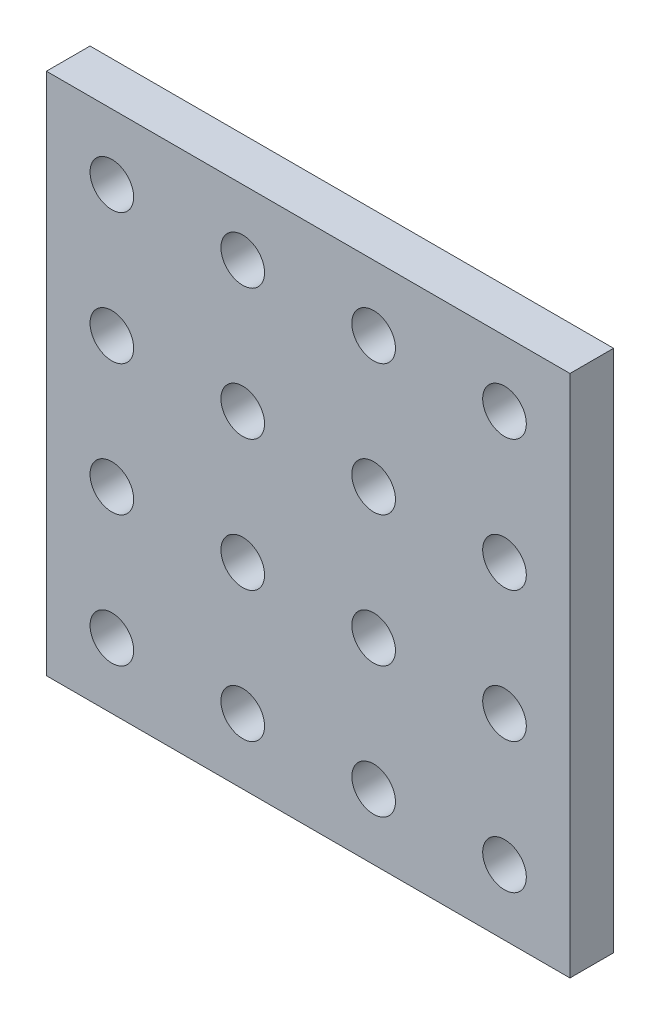
ISO-10303-21;
HEADER;
FILE_DESCRIPTION(('STEP AP214'),'2;1');
FILE_NAME('part.step','',(''),(''),'','','');
FILE_SCHEMA(('AUTOMOTIVE_DESIGN { 1 0 10303 214 1 1 1 1 }'));
ENDSEC;
DATA;
#1=APPLICATION_CONTEXT('core data for automotive mechanical design processes');
#2=APPLICATION_PROTOCOL_DEFINITION('international standard','automotive_design',2000,#1);
#3=PRODUCT_CONTEXT('',#1,'mechanical');
#4=PRODUCT('Part','Part','',(#3));
#5=PRODUCT_RELATED_PRODUCT_CATEGORY('part','',(#4));
#6=PRODUCT_DEFINITION_FORMATION('','',#4);
#7=PRODUCT_DEFINITION_CONTEXT('part definition',#1,'design');
#8=PRODUCT_DEFINITION('design','',#6,#7);
#9=PRODUCT_DEFINITION_SHAPE('','',#8);
#10=(LENGTH_UNIT() NAMED_UNIT(*) SI_UNIT(.MILLI.,.METRE.));
#11=(NAMED_UNIT(*) PLANE_ANGLE_UNIT() SI_UNIT($,.RADIAN.));
#12=(NAMED_UNIT(*) SI_UNIT($,.STERADIAN.) SOLID_ANGLE_UNIT());
#13=UNCERTAINTY_MEASURE_WITH_UNIT(LENGTH_MEASURE(1.E-05),#10,'distance_accuracy_value','');
#14=(GEOMETRIC_REPRESENTATION_CONTEXT(3) GLOBAL_UNCERTAINTY_ASSIGNED_CONTEXT((#13)) GLOBAL_UNIT_ASSIGNED_CONTEXT((#10,
#11,#12)) REPRESENTATION_CONTEXT('',''));
#15=CARTESIAN_POINT('',(0.,0.,0.));
#16=DIRECTION('',(0.,0.,1.));
#17=DIRECTION('',(1.,0.,0.));
#18=AXIS2_PLACEMENT_3D('',#15,#16,#17);
#19=CARTESIAN_POINT('',(0.,0.,10.));
#20=DIRECTION('',(0.,0.,1.));
#21=DIRECTION('',(1.,0.,0.));
#22=AXIS2_PLACEMENT_3D('',#19,#20,#21);
#23=PLANE('',#22);
#24=CARTESIAN_POINT('',(15.0000000000006,44.9999999999999,10.));
#25=DIRECTION('',(0.,0.,1.));
#26=DIRECTION('',(1.,0.,0.));
#27=AXIS2_PLACEMENT_3D('',#24,#25,#26);
#28=CIRCLE('',#27,5.);
#29=CARTESIAN_POINT('',(20.0000000000006,44.9999999999999,10.));
#30=VERTEX_POINT('',#29);
#31=EDGE_CURVE('E280',#30,#30,#28,.T.);
#32=ORIENTED_EDGE('',*,*,#31,.F.);
#33=EDGE_LOOP('',(#32));
#34=FACE_BOUND('',#33,.T.);
#35=CARTESIAN_POINT('',(105.000000000001,15.,10.));
#36=DIRECTION('',(0.,0.,1.));
#37=DIRECTION('',(1.,0.,0.));
#38=AXIS2_PLACEMENT_3D('',#35,#36,#37);
#39=CIRCLE('',#38,5.00000000000001);
#40=CARTESIAN_POINT('',(110.000000000001,14.9999999999999,10.));
#41=VERTEX_POINT('',#40);
#42=EDGE_CURVE('E292',#41,#41,#39,.T.);
#43=ORIENTED_EDGE('',*,*,#42,.F.);
#44=EDGE_LOOP('',(#43));
#45=FACE_BOUND('',#44,.T.);
#46=CARTESIAN_POINT('',(45.0000000000009,14.9999999999999,10.));
#47=DIRECTION('',(0.,0.,1.));
#48=DIRECTION('',(1.,0.,0.));
#49=AXIS2_PLACEMENT_3D('',#46,#47,#48);
#50=CIRCLE('',#49,5.);
#51=CARTESIAN_POINT('',(50.0000000000009,14.9999999999999,10.));
#52=VERTEX_POINT('',#51);
#53=EDGE_CURVE('E304',#52,#52,#50,.T.);
#54=ORIENTED_EDGE('',*,*,#53,.F.);
#55=EDGE_LOOP('',(#54));
#56=FACE_BOUND('',#55,.T.);
#57=CARTESIAN_POINT('',(75.0000000000008,45.,10.));
#58=DIRECTION('',(0.,0.,1.));
#59=DIRECTION('',(1.,0.,0.));
#60=AXIS2_PLACEMENT_3D('',#57,#58,#59);
#61=CIRCLE('',#60,5.00000000000001);
#62=CARTESIAN_POINT('',(80.0000000000008,45.,10.));
#63=VERTEX_POINT('',#62);
#64=EDGE_CURVE('E316',#63,#63,#61,.T.);
#65=ORIENTED_EDGE('',*,*,#64,.F.);
#66=EDGE_LOOP('',(#65));
#67=FACE_BOUND('',#66,.T.);
#68=CARTESIAN_POINT('',(105.,75.,10.0000000000001));
#69=DIRECTION('',(0.,0.,1.));
#70=DIRECTION('',(1.,0.,0.));
#71=AXIS2_PLACEMENT_3D('',#68,#69,#70);
#72=CIRCLE('',#71,5.00000000000001);
#73=CARTESIAN_POINT('',(110.,75.,10.0000000000001));
#74=VERTEX_POINT('',#73);
#75=EDGE_CURVE('E328',#74,#74,#72,.T.);
#76=ORIENTED_EDGE('',*,*,#75,.F.);
#77=EDGE_LOOP('',(#76));
#78=FACE_BOUND('',#77,.T.);
#79=CARTESIAN_POINT('',(45.0000000000003,75.,10.0000000000002));
#80=DIRECTION('',(0.,0.,1.));
#81=DIRECTION('',(1.,0.,0.));
#82=AXIS2_PLACEMENT_3D('',#79,#80,#81);
#83=CIRCLE('',#82,5.);
#84=CARTESIAN_POINT('',(50.0000000000003,75.,10.0000000000002));
#85=VERTEX_POINT('',#84);
#86=EDGE_CURVE('E340',#85,#85,#83,.T.);
#87=ORIENTED_EDGE('',*,*,#86,.F.);
#88=EDGE_LOOP('',(#87));
#89=FACE_BOUND('',#88,.T.);
#90=CARTESIAN_POINT('',(75.0000000000001,105.,10.));
#91=DIRECTION('',(0.,0.,1.));
#92=DIRECTION('',(1.,0.,0.));
#93=AXIS2_PLACEMENT_3D('',#90,#91,#92);
#94=CIRCLE('',#93,5.00000000000001);
#95=CARTESIAN_POINT('',(80.0000000000001,105.,10.));
#96=VERTEX_POINT('',#95);
#97=EDGE_CURVE('E352',#96,#96,#94,.T.);
#98=ORIENTED_EDGE('',*,*,#97,.F.);
#99=EDGE_LOOP('',(#98));
#100=FACE_BOUND('',#99,.T.);
#101=CARTESIAN_POINT('',(15.,105.,10.));
#102=DIRECTION('',(0.,0.,1.));
#103=DIRECTION('',(1.,0.,0.));
#104=AXIS2_PLACEMENT_3D('',#101,#102,#103);
#105=CIRCLE('',#104,5.);
#106=CARTESIAN_POINT('',(20.,105.,10.));
#107=VERTEX_POINT('',#106);
#108=EDGE_CURVE('E101',#107,#107,#105,.T.);
#109=ORIENTED_EDGE('',*,*,#108,.F.);
#110=EDGE_LOOP('',(#109));
#111=FACE_BOUND('',#110,.T.);
#112=DIRECTION('',(0.,-1.,0.));
#113=VECTOR('',#112,1.);
#114=CARTESIAN_POINT('',(0.,120.,10.));
#115=LINE('',#114,#113);
#116=CARTESIAN_POINT('',(0.,120.,10.));
#117=VERTEX_POINT('',#116);
#118=CARTESIAN_POINT('',(0.,0.,10.));
#119=VERTEX_POINT('',#118);
#120=EDGE_CURVE('E92',#117,#119,#115,.T.);
#121=ORIENTED_EDGE('',*,*,#120,.T.);
#122=DIRECTION('',(1.,0.,0.));
#123=VECTOR('',#122,1.);
#124=CARTESIAN_POINT('',(0.,0.,10.));
#125=LINE('',#124,#123);
#126=CARTESIAN_POINT('',(120.,0.,10.));
#127=VERTEX_POINT('',#126);
#128=EDGE_CURVE('E79',#119,#127,#125,.T.);
#129=ORIENTED_EDGE('',*,*,#128,.T.);
#130=DIRECTION('',(0.,1.,0.));
#131=VECTOR('',#130,1.);
#132=CARTESIAN_POINT('',(120.,0.,10.));
#133=LINE('',#132,#131);
#134=CARTESIAN_POINT('',(120.,120.,9.99999999999984));
#135=VERTEX_POINT('',#134);
#136=EDGE_CURVE('E86',#127,#135,#133,.T.);
#137=ORIENTED_EDGE('',*,*,#136,.T.);
#138=DIRECTION('',(-1.,0.,0.));
#139=VECTOR('',#138,1.);
#140=CARTESIAN_POINT('',(120.,120.,9.99999999999984));
#141=LINE('',#140,#139);
#142=EDGE_CURVE('E89',#135,#117,#141,.T.);
#143=ORIENTED_EDGE('',*,*,#142,.T.);
#144=EDGE_LOOP('',(#121,#129,#137,#143));
#145=FACE_BOUND('',#144,.T.);
#146=CARTESIAN_POINT('',(44.9999999999999,105.,10.));
#147=DIRECTION('',(0.,0.,1.));
#148=DIRECTION('',(1.,0.,0.));
#149=AXIS2_PLACEMENT_3D('',#146,#147,#148);
#150=CIRCLE('',#149,5.00000000000001);
#151=CARTESIAN_POINT('',(49.9999999999999,105.,10.));
#152=VERTEX_POINT('',#151);
#153=EDGE_CURVE('E358',#152,#152,#150,.T.);
#154=ORIENTED_EDGE('',*,*,#153,.F.);
#155=EDGE_LOOP('',(#154));
#156=FACE_BOUND('',#155,.T.);
#157=CARTESIAN_POINT('',(105.,105.,10.));
#158=DIRECTION('',(0.,0.,1.));
#159=DIRECTION('',(1.,0.,0.));
#160=AXIS2_PLACEMENT_3D('',#157,#158,#159);
#161=CIRCLE('',#160,5.00000000000001);
#162=CARTESIAN_POINT('',(110.,105.,10.));
#163=VERTEX_POINT('',#162);
#164=EDGE_CURVE('E346',#163,#163,#161,.T.);
#165=ORIENTED_EDGE('',*,*,#164,.F.);
#166=EDGE_LOOP('',(#165));
#167=FACE_BOUND('',#166,.T.);
#168=CARTESIAN_POINT('',(75.0000000000005,75.,10.0000000000001));
#169=DIRECTION('',(0.,0.,1.));
#170=DIRECTION('',(1.,0.,0.));
#171=AXIS2_PLACEMENT_3D('',#168,#169,#170);
#172=CIRCLE('',#171,4.99999999999999);
#173=CARTESIAN_POINT('',(80.0000000000005,75.,10.0000000000001));
#174=VERTEX_POINT('',#173);
#175=EDGE_CURVE('E334',#174,#174,#172,.T.);
#176=ORIENTED_EDGE('',*,*,#175,.F.);
#177=EDGE_LOOP('',(#176));
#178=FACE_BOUND('',#177,.T.);
#179=CARTESIAN_POINT('',(45.0000000000006,44.9999999999999,10.));
#180=DIRECTION('',(0.,0.,1.));
#181=DIRECTION('',(1.,0.,0.));
#182=AXIS2_PLACEMENT_3D('',#179,#180,#181);
#183=CIRCLE('',#182,5.00000000000001);
#184=CARTESIAN_POINT('',(50.0000000000006,44.9999999999999,10.));
#185=VERTEX_POINT('',#184);
#186=EDGE_CURVE('E322',#185,#185,#183,.T.);
#187=ORIENTED_EDGE('',*,*,#186,.F.);
#188=EDGE_LOOP('',(#187));
#189=FACE_BOUND('',#188,.T.);
#190=CARTESIAN_POINT('',(105.000000000001,45.,10.0000000000001));
#191=DIRECTION('',(0.,0.,1.));
#192=DIRECTION('',(1.,0.,0.));
#193=AXIS2_PLACEMENT_3D('',#190,#191,#192);
#194=CIRCLE('',#193,5.00000000000001);
#195=CARTESIAN_POINT('',(110.000000000001,45.,10.0000000000001));
#196=VERTEX_POINT('',#195);
#197=EDGE_CURVE('E310',#196,#196,#194,.T.);
#198=ORIENTED_EDGE('',*,*,#197,.F.);
#199=EDGE_LOOP('',(#198));
#200=FACE_BOUND('',#199,.T.);
#201=CARTESIAN_POINT('',(75.0000000000011,14.9999999999999,10.));
#202=DIRECTION('',(0.,0.,1.));
#203=DIRECTION('',(1.,0.,0.));
#204=AXIS2_PLACEMENT_3D('',#201,#202,#203);
#205=CIRCLE('',#204,4.99999999999999);
#206=CARTESIAN_POINT('',(80.000000000001,14.9999999999999,10.));
#207=VERTEX_POINT('',#206);
#208=EDGE_CURVE('E298',#207,#207,#205,.T.);
#209=ORIENTED_EDGE('',*,*,#208,.F.);
#210=EDGE_LOOP('',(#209));
#211=FACE_BOUND('',#210,.T.);
#212=CARTESIAN_POINT('',(15.0000000000003,75.,10.0000000000002));
#213=DIRECTION('',(0.,0.,1.));
#214=DIRECTION('',(1.,0.,0.));
#215=AXIS2_PLACEMENT_3D('',#212,#213,#214);
#216=CIRCLE('',#215,5.);
#217=CARTESIAN_POINT('',(20.0000000000003,75.,10.0000000000002));
#218=VERTEX_POINT('',#217);
#219=EDGE_CURVE('E286',#218,#218,#216,.T.);
#220=ORIENTED_EDGE('',*,*,#219,.F.);
#221=EDGE_LOOP('',(#220));
#222=FACE_BOUND('',#221,.T.);
#223=CARTESIAN_POINT('',(15.0000000000009,14.9999999999999,10.));
#224=DIRECTION('',(0.,0.,1.));
#225=DIRECTION('',(1.,0.,0.));
#226=AXIS2_PLACEMENT_3D('',#223,#224,#225);
#227=CIRCLE('',#226,5.);
#228=CARTESIAN_POINT('',(20.0000000000009,14.9999999999999,10.));
#229=VERTEX_POINT('',#228);
#230=EDGE_CURVE('E271',#229,#229,#227,.T.);
#231=ORIENTED_EDGE('',*,*,#230,.F.);
#232=EDGE_LOOP('',(#231));
#233=FACE_BOUND('',#232,.T.);
#234=ADVANCED_FACE('F34',(#34,#45,#56,#67,#78,#89,#100,#111,#145,#156,#167,#178,#189,#200,#211,
#222,#233),#23,.T.);
#235=CARTESIAN_POINT('',(0.,0.,0.));
#236=DIRECTION('',(0.,0.,1.));
#237=DIRECTION('',(1.,0.,0.));
#238=AXIS2_PLACEMENT_3D('',#235,#236,#237);
#239=PLANE('',#238);
#240=DIRECTION('',(0.,-1.,0.));
#241=VECTOR('',#240,1.);
#242=CARTESIAN_POINT('',(0.,120.,0.));
#243=LINE('',#242,#241);
#244=CARTESIAN_POINT('',(0.,120.,0.));
#245=VERTEX_POINT('',#244);
#246=CARTESIAN_POINT('',(0.,0.,0.));
#247=VERTEX_POINT('',#246);
#248=EDGE_CURVE('E99',#245,#247,#243,.T.);
#249=ORIENTED_EDGE('',*,*,#248,.F.);
#250=DIRECTION('',(-1.,0.,0.));
#251=VECTOR('',#250,1.);
#252=CARTESIAN_POINT('',(120.,120.,-2.08166817117217E-13));
#253=LINE('',#252,#251);
#254=CARTESIAN_POINT('',(120.,120.,-2.08166817117217E-13));
#255=VERTEX_POINT('',#254);
#256=EDGE_CURVE('E94',#255,#245,#253,.T.);
#257=ORIENTED_EDGE('',*,*,#256,.F.);
#258=DIRECTION('',(0.,1.,0.));
#259=VECTOR('',#258,1.);
#260=CARTESIAN_POINT('',(120.,0.,-1.80411241501588E-13));
#261=LINE('',#260,#259);
#262=CARTESIAN_POINT('',(120.,0.,-1.80411241501588E-13));
#263=VERTEX_POINT('',#262);
#264=EDGE_CURVE('E103',#263,#255,#261,.T.);
#265=ORIENTED_EDGE('',*,*,#264,.F.);
#266=DIRECTION('',(1.,0.,0.));
#267=VECTOR('',#266,1.);
#268=CARTESIAN_POINT('',(0.,0.,0.));
#269=LINE('',#268,#267);
#270=EDGE_CURVE('E82',#247,#263,#269,.T.);
#271=ORIENTED_EDGE('',*,*,#270,.F.);
#272=EDGE_LOOP('',(#249,#257,#265,#271));
#273=FACE_BOUND('',#272,.T.);
#274=CARTESIAN_POINT('',(15.,105.,0.));
#275=DIRECTION('',(0.,0.,1.));
#276=DIRECTION('',(1.,0.,0.));
#277=AXIS2_PLACEMENT_3D('',#274,#275,#276);
#278=CIRCLE('',#277,5.);
#279=CARTESIAN_POINT('',(20.,105.,0.));
#280=VERTEX_POINT('',#279);
#281=EDGE_CURVE('E361',#280,#280,#278,.T.);
#282=ORIENTED_EDGE('',*,*,#281,.T.);
#283=EDGE_LOOP('',(#282));
#284=FACE_BOUND('',#283,.T.);
#285=CARTESIAN_POINT('',(45.,105.,0.));
#286=DIRECTION('',(0.,0.,1.));
#287=DIRECTION('',(1.,0.,0.));
#288=AXIS2_PLACEMENT_3D('',#285,#286,#287);
#289=CIRCLE('',#288,5.00000000000001);
#290=CARTESIAN_POINT('',(50.,105.,0.));
#291=VERTEX_POINT('',#290);
#292=EDGE_CURVE('E355',#291,#291,#289,.T.);
#293=ORIENTED_EDGE('',*,*,#292,.T.);
#294=EDGE_LOOP('',(#293));
#295=FACE_BOUND('',#294,.T.);
#296=CARTESIAN_POINT('',(75.0000000000001,105.,0.));
#297=DIRECTION('',(0.,0.,1.));
#298=DIRECTION('',(1.,0.,0.));
#299=AXIS2_PLACEMENT_3D('',#296,#297,#298);
#300=CIRCLE('',#299,5.00000000000001);
#301=CARTESIAN_POINT('',(80.0000000000001,105.,0.));
#302=VERTEX_POINT('',#301);
#303=EDGE_CURVE('E349',#302,#302,#300,.T.);
#304=ORIENTED_EDGE('',*,*,#303,.T.);
#305=EDGE_LOOP('',(#304));
#306=FACE_BOUND('',#305,.T.);
#307=CARTESIAN_POINT('',(105.,105.,0.));
#308=DIRECTION('',(0.,0.,1.));
#309=DIRECTION('',(1.,0.,0.));
#310=AXIS2_PLACEMENT_3D('',#307,#308,#309);
#311=CIRCLE('',#310,5.00000000000001);
#312=CARTESIAN_POINT('',(110.,105.,0.));
#313=VERTEX_POINT('',#312);
#314=EDGE_CURVE('E343',#313,#313,#311,.T.);
#315=ORIENTED_EDGE('',*,*,#314,.T.);
#316=EDGE_LOOP('',(#315));
#317=FACE_BOUND('',#316,.T.);
#318=CARTESIAN_POINT('',(45.0000000000003,75.,1.94289029309402E-13));
#319=DIRECTION('',(0.,0.,1.));
#320=DIRECTION('',(1.,0.,0.));
#321=AXIS2_PLACEMENT_3D('',#318,#319,#320);
#322=CIRCLE('',#321,5.);
#323=CARTESIAN_POINT('',(50.0000000000003,75.,1.93595139919012E-13));
#324=VERTEX_POINT('',#323);
#325=EDGE_CURVE('E337',#324,#324,#322,.T.);
#326=ORIENTED_EDGE('',*,*,#325,.T.);
#327=EDGE_LOOP('',(#326));
#328=FACE_BOUND('',#327,.T.);
#329=CARTESIAN_POINT('',(75.0000000000005,75.,1.94289029309402E-13));
#330=DIRECTION('',(0.,0.,1.));
#331=DIRECTION('',(1.,0.,0.));
#332=AXIS2_PLACEMENT_3D('',#329,#330,#331);
#333=CIRCLE('',#332,4.99999999999999);
#334=CARTESIAN_POINT('',(80.0000000000005,75.,1.93595139919012E-13));
#335=VERTEX_POINT('',#334);
#336=EDGE_CURVE('E331',#335,#335,#333,.T.);
#337=ORIENTED_EDGE('',*,*,#336,.T.);
#338=EDGE_LOOP('',(#337));
#339=FACE_BOUND('',#338,.T.);
#340=CARTESIAN_POINT('',(105.,75.,1.52655665885959E-13));
#341=DIRECTION('',(0.,0.,1.));
#342=DIRECTION('',(1.,0.,0.));
#343=AXIS2_PLACEMENT_3D('',#340,#341,#342);
#344=CIRCLE('',#343,5.00000000000001);
#345=CARTESIAN_POINT('',(110.,75.,1.51961776495568E-13));
#346=VERTEX_POINT('',#345);
#347=EDGE_CURVE('E325',#346,#346,#344,.T.);
#348=ORIENTED_EDGE('',*,*,#347,.T.);
#349=EDGE_LOOP('',(#348));
#350=FACE_BOUND('',#349,.T.);
#351=CARTESIAN_POINT('',(45.0000000000006,44.9999999999999,0.));
#352=DIRECTION('',(0.,0.,1.));
#353=DIRECTION('',(1.,0.,0.));
#354=AXIS2_PLACEMENT_3D('',#351,#352,#353);
#355=CIRCLE('',#354,5.00000000000001);
#356=CARTESIAN_POINT('',(50.0000000000006,44.9999999999999,0.));
#357=VERTEX_POINT('',#356);
#358=EDGE_CURVE('E319',#357,#357,#355,.T.);
#359=ORIENTED_EDGE('',*,*,#358,.T.);
#360=EDGE_LOOP('',(#359));
#361=FACE_BOUND('',#360,.T.);
#362=CARTESIAN_POINT('',(75.0000000000008,45.,0.));
#363=DIRECTION('',(0.,0.,1.));
#364=DIRECTION('',(1.,0.,0.));
#365=AXIS2_PLACEMENT_3D('',#362,#363,#364);
#366=CIRCLE('',#365,5.00000000000001);
#367=CARTESIAN_POINT('',(80.0000000000008,45.,0.));
#368=VERTEX_POINT('',#367);
#369=EDGE_CURVE('E313',#368,#368,#366,.T.);
#370=ORIENTED_EDGE('',*,*,#369,.T.);
#371=EDGE_LOOP('',(#370));
#372=FACE_BOUND('',#371,.T.);
#373=CARTESIAN_POINT('',(105.000000000001,45.,1.94289029309402E-13));
#374=DIRECTION('',(0.,0.,1.));
#375=DIRECTION('',(1.,0.,0.));
#376=AXIS2_PLACEMENT_3D('',#373,#374,#375);
#377=CIRCLE('',#376,5.00000000000001);
#378=CARTESIAN_POINT('',(110.000000000001,45.,1.93595139919012E-13));
#379=VERTEX_POINT('',#378);
#380=EDGE_CURVE('E307',#379,#379,#377,.T.);
#381=ORIENTED_EDGE('',*,*,#380,.T.);
#382=EDGE_LOOP('',(#381));
#383=FACE_BOUND('',#382,.T.);
#384=CARTESIAN_POINT('',(45.0000000000009,14.9999999999999,0.));
#385=DIRECTION('',(0.,0.,1.));
#386=DIRECTION('',(1.,0.,0.));
#387=AXIS2_PLACEMENT_3D('',#384,#385,#386);
#388=CIRCLE('',#387,5.);
#389=CARTESIAN_POINT('',(50.0000000000009,14.9999999999999,0.));
#390=VERTEX_POINT('',#389);
#391=EDGE_CURVE('E301',#390,#390,#388,.T.);
#392=ORIENTED_EDGE('',*,*,#391,.T.);
#393=EDGE_LOOP('',(#392));
#394=FACE_BOUND('',#393,.T.);
#395=CARTESIAN_POINT('',(75.0000000000011,15.,0.));
#396=DIRECTION('',(0.,0.,1.));
#397=DIRECTION('',(1.,0.,0.));
#398=AXIS2_PLACEMENT_3D('',#395,#396,#397);
#399=CIRCLE('',#398,4.99999999999999);
#400=CARTESIAN_POINT('',(80.0000000000011,14.9999999999999,0.));
#401=VERTEX_POINT('',#400);
#402=EDGE_CURVE('E295',#401,#401,#399,.T.);
#403=ORIENTED_EDGE('',*,*,#402,.T.);
#404=EDGE_LOOP('',(#403));
#405=FACE_BOUND('',#404,.T.);
#406=CARTESIAN_POINT('',(105.000000000001,15.,0.));
#407=DIRECTION('',(0.,0.,1.));
#408=DIRECTION('',(1.,0.,0.));
#409=AXIS2_PLACEMENT_3D('',#406,#407,#408);
#410=CIRCLE('',#409,5.00000000000001);
#411=CARTESIAN_POINT('',(110.000000000001,14.9999999999999,0.));
#412=VERTEX_POINT('',#411);
#413=EDGE_CURVE('E289',#412,#412,#410,.T.);
#414=ORIENTED_EDGE('',*,*,#413,.T.);
#415=EDGE_LOOP('',(#414));
#416=FACE_BOUND('',#415,.T.);
#417=CARTESIAN_POINT('',(15.0000000000002,75.,2.08166817117217E-13));
#418=DIRECTION('',(0.,0.,1.));
#419=DIRECTION('',(1.,0.,0.));
#420=AXIS2_PLACEMENT_3D('',#417,#418,#419);
#421=CIRCLE('',#420,5.);
#422=CARTESIAN_POINT('',(20.0000000000002,75.,2.07472927726826E-13));
#423=VERTEX_POINT('',#422);
#424=EDGE_CURVE('E283',#423,#423,#421,.T.);
#425=ORIENTED_EDGE('',*,*,#424,.T.);
#426=EDGE_LOOP('',(#425));
#427=FACE_BOUND('',#426,.T.);
#428=CARTESIAN_POINT('',(15.0000000000006,45.,0.));
#429=DIRECTION('',(0.,0.,1.));
#430=DIRECTION('',(1.,0.,0.));
#431=AXIS2_PLACEMENT_3D('',#428,#429,#430);
#432=CIRCLE('',#431,5.);
#433=CARTESIAN_POINT('',(20.0000000000006,45.,0.));
#434=VERTEX_POINT('',#433);
#435=EDGE_CURVE('E277',#434,#434,#432,.T.);
#436=ORIENTED_EDGE('',*,*,#435,.T.);
#437=EDGE_LOOP('',(#436));
#438=FACE_BOUND('',#437,.T.);
#439=CARTESIAN_POINT('',(15.0000000000009,15.,0.));
#440=DIRECTION('',(0.,0.,1.));
#441=DIRECTION('',(1.,0.,0.));
#442=AXIS2_PLACEMENT_3D('',#439,#440,#441);
#443=CIRCLE('',#442,5.);
#444=CARTESIAN_POINT('',(20.0000000000009,14.9999999999999,0.));
#445=VERTEX_POINT('',#444);
#446=EDGE_CURVE('E274',#445,#445,#443,.T.);
#447=ORIENTED_EDGE('',*,*,#446,.T.);
#448=EDGE_LOOP('',(#447));
#449=FACE_BOUND('',#448,.T.);
#450=ADVANCED_FACE('F111',(#273,#284,#295,#306,#317,#328,#339,#350,#361,#372,#383,#394,#405,
#416,#427,#438,#449),#239,.F.);
#451=CARTESIAN_POINT('',(0.,120.,10.));
#452=DIRECTION('',(1.,0.,0.));
#453=DIRECTION('',(0.,0.,-1.));
#454=AXIS2_PLACEMENT_3D('',#451,#452,#453);
#455=PLANE('',#454);
#456=ORIENTED_EDGE('',*,*,#248,.T.);
#457=DIRECTION('',(0.,0.,-1.));
#458=VECTOR('',#457,1.);
#459=CARTESIAN_POINT('',(0.,0.,10.));
#460=LINE('',#459,#458);
#461=EDGE_CURVE('E11',#119,#247,#460,.T.);
#462=ORIENTED_EDGE('',*,*,#461,.F.);
#463=ORIENTED_EDGE('',*,*,#120,.F.);
#464=DIRECTION('',(0.,0.,-1.));
#465=VECTOR('',#464,1.);
#466=CARTESIAN_POINT('',(0.,120.,10.));
#467=LINE('',#466,#465);
#468=EDGE_CURVE('E51',#117,#245,#467,.T.);
#469=ORIENTED_EDGE('',*,*,#468,.T.);
#470=EDGE_LOOP('',(#456,#462,#463,#469));
#471=FACE_BOUND('',#470,.T.);
#472=ADVANCED_FACE('F36',(#471),#455,.F.);
#473=CARTESIAN_POINT('',(0.,0.,10.));
#474=DIRECTION('',(0.,1.,0.));
#475=DIRECTION('',(0.,0.,1.));
#476=AXIS2_PLACEMENT_3D('',#473,#474,#475);
#477=PLANE('',#476);
#478=ORIENTED_EDGE('',*,*,#270,.T.);
#479=DIRECTION('',(0.,0.,-1.));
#480=VECTOR('',#479,1.);
#481=CARTESIAN_POINT('',(120.,0.,10.));
#482=LINE('',#481,#480);
#483=EDGE_CURVE('E43',#127,#263,#482,.T.);
#484=ORIENTED_EDGE('',*,*,#483,.F.);
#485=ORIENTED_EDGE('',*,*,#128,.F.);
#486=ORIENTED_EDGE('',*,*,#461,.T.);
#487=EDGE_LOOP('',(#478,#484,#485,#486));
#488=FACE_BOUND('',#487,.T.);
#489=ADVANCED_FACE('F77',(#488),#477,.F.);
#490=CARTESIAN_POINT('',(120.,0.,10.));
#491=DIRECTION('',(-1.,0.,0.));
#492=DIRECTION('',(0.,0.,1.));
#493=AXIS2_PLACEMENT_3D('',#490,#491,#492);
#494=PLANE('',#493);
#495=ORIENTED_EDGE('',*,*,#264,.T.);
#496=DIRECTION('',(0.,0.,-1.));
#497=VECTOR('',#496,1.);
#498=CARTESIAN_POINT('',(120.,120.,9.99999999999984));
#499=LINE('',#498,#497);
#500=EDGE_CURVE('E64',#135,#255,#499,.T.);
#501=ORIENTED_EDGE('',*,*,#500,.F.);
#502=ORIENTED_EDGE('',*,*,#136,.F.);
#503=ORIENTED_EDGE('',*,*,#483,.T.);
#504=EDGE_LOOP('',(#495,#501,#502,#503));
#505=FACE_BOUND('',#504,.T.);
#506=ADVANCED_FACE('F87',(#505),#494,.F.);
#507=CARTESIAN_POINT('',(120.,120.,9.99999999999984));
#508=DIRECTION('',(0.,-1.,0.));
#509=DIRECTION('',(0.,0.,-1.));
#510=AXIS2_PLACEMENT_3D('',#507,#508,#509);
#511=PLANE('',#510);
#512=ORIENTED_EDGE('',*,*,#256,.T.);
#513=ORIENTED_EDGE('',*,*,#468,.F.);
#514=ORIENTED_EDGE('',*,*,#142,.F.);
#515=ORIENTED_EDGE('',*,*,#500,.T.);
#516=EDGE_LOOP('',(#512,#513,#514,#515));
#517=FACE_BOUND('',#516,.T.);
#518=ADVANCED_FACE('F109',(#517),#511,.F.);
#519=CARTESIAN_POINT('',(15.,105.,10.));
#520=DIRECTION('',(0.,0.,-1.));
#521=DIRECTION('',(-1.,0.,0.));
#522=AXIS2_PLACEMENT_3D('',#519,#520,#521);
#523=CYLINDRICAL_SURFACE('',#522,5.);
#524=ORIENTED_EDGE('',*,*,#108,.T.);
#525=EDGE_LOOP('',(#524));
#526=FACE_BOUND('',#525,.T.);
#527=ORIENTED_EDGE('',*,*,#281,.F.);
#528=EDGE_LOOP('',(#527));
#529=FACE_BOUND('',#528,.T.);
#530=ADVANCED_FACE('F127',(#526,#529),#523,.F.);
#531=CARTESIAN_POINT('',(44.9999999999999,105.,10.));
#532=DIRECTION('',(0.,0.,-1.));
#533=DIRECTION('',(-1.,0.,0.));
#534=AXIS2_PLACEMENT_3D('',#531,#532,#533);
#535=CYLINDRICAL_SURFACE('',#534,5.00000000000001);
#536=ORIENTED_EDGE('',*,*,#153,.T.);
#537=EDGE_LOOP('',(#536));
#538=FACE_BOUND('',#537,.T.);
#539=ORIENTED_EDGE('',*,*,#292,.F.);
#540=EDGE_LOOP('',(#539));
#541=FACE_BOUND('',#540,.T.);
#542=ADVANCED_FACE('F147',(#538,#541),#535,.F.);
#543=CARTESIAN_POINT('',(75.0000000000001,105.,10.));
#544=DIRECTION('',(0.,0.,-1.));
#545=DIRECTION('',(-1.,0.,0.));
#546=AXIS2_PLACEMENT_3D('',#543,#544,#545);
#547=CYLINDRICAL_SURFACE('',#546,5.00000000000001);
#548=ORIENTED_EDGE('',*,*,#97,.T.);
#549=EDGE_LOOP('',(#548));
#550=FACE_BOUND('',#549,.T.);
#551=ORIENTED_EDGE('',*,*,#303,.F.);
#552=EDGE_LOOP('',(#551));
#553=FACE_BOUND('',#552,.T.);
#554=ADVANCED_FACE('F154',(#550,#553),#547,.F.);
#555=CARTESIAN_POINT('',(105.,105.,10.));
#556=DIRECTION('',(0.,0.,-1.));
#557=DIRECTION('',(-1.,0.,0.));
#558=AXIS2_PLACEMENT_3D('',#555,#556,#557);
#559=CYLINDRICAL_SURFACE('',#558,5.00000000000001);
#560=ORIENTED_EDGE('',*,*,#164,.T.);
#561=EDGE_LOOP('',(#560));
#562=FACE_BOUND('',#561,.T.);
#563=ORIENTED_EDGE('',*,*,#314,.F.);
#564=EDGE_LOOP('',(#563));
#565=FACE_BOUND('',#564,.T.);
#566=ADVANCED_FACE('F161',(#562,#565),#559,.F.);
#567=CARTESIAN_POINT('',(45.0000000000003,75.,10.0000000000002));
#568=DIRECTION('',(0.,0.,-1.));
#569=DIRECTION('',(-1.,0.,0.));
#570=AXIS2_PLACEMENT_3D('',#567,#568,#569);
#571=CYLINDRICAL_SURFACE('',#570,5.);
#572=ORIENTED_EDGE('',*,*,#86,.T.);
#573=EDGE_LOOP('',(#572));
#574=FACE_BOUND('',#573,.T.);
#575=ORIENTED_EDGE('',*,*,#325,.F.);
#576=EDGE_LOOP('',(#575));
#577=FACE_BOUND('',#576,.T.);
#578=ADVANCED_FACE('F169',(#574,#577),#571,.F.);
#579=CARTESIAN_POINT('',(75.0000000000005,75.,10.0000000000001));
#580=DIRECTION('',(0.,0.,-1.));
#581=DIRECTION('',(-1.,0.,0.));
#582=AXIS2_PLACEMENT_3D('',#579,#580,#581);
#583=CYLINDRICAL_SURFACE('',#582,4.99999999999999);
#584=ORIENTED_EDGE('',*,*,#175,.T.);
#585=EDGE_LOOP('',(#584));
#586=FACE_BOUND('',#585,.T.);
#587=ORIENTED_EDGE('',*,*,#336,.F.);
#588=EDGE_LOOP('',(#587));
#589=FACE_BOUND('',#588,.T.);
#590=ADVANCED_FACE('F177',(#586,#589),#583,.F.);
#591=CARTESIAN_POINT('',(105.,75.,10.0000000000001));
#592=DIRECTION('',(0.,0.,-1.));
#593=DIRECTION('',(-1.,0.,0.));
#594=AXIS2_PLACEMENT_3D('',#591,#592,#593);
#595=CYLINDRICAL_SURFACE('',#594,5.00000000000001);
#596=ORIENTED_EDGE('',*,*,#75,.T.);
#597=EDGE_LOOP('',(#596));
#598=FACE_BOUND('',#597,.T.);
#599=ORIENTED_EDGE('',*,*,#347,.F.);
#600=EDGE_LOOP('',(#599));
#601=FACE_BOUND('',#600,.T.);
#602=ADVANCED_FACE('F185',(#598,#601),#595,.F.);
#603=CARTESIAN_POINT('',(45.0000000000006,44.9999999999999,10.));
#604=DIRECTION('',(0.,0.,-1.));
#605=DIRECTION('',(-1.,0.,0.));
#606=AXIS2_PLACEMENT_3D('',#603,#604,#605);
#607=CYLINDRICAL_SURFACE('',#606,5.00000000000001);
#608=ORIENTED_EDGE('',*,*,#186,.T.);
#609=EDGE_LOOP('',(#608));
#610=FACE_BOUND('',#609,.T.);
#611=ORIENTED_EDGE('',*,*,#358,.F.);
#612=EDGE_LOOP('',(#611));
#613=FACE_BOUND('',#612,.T.);
#614=ADVANCED_FACE('F193',(#610,#613),#607,.F.);
#615=CARTESIAN_POINT('',(75.0000000000008,45.,10.));
#616=DIRECTION('',(0.,0.,-1.));
#617=DIRECTION('',(-1.,0.,0.));
#618=AXIS2_PLACEMENT_3D('',#615,#616,#617);
#619=CYLINDRICAL_SURFACE('',#618,5.00000000000001);
#620=ORIENTED_EDGE('',*,*,#64,.T.);
#621=EDGE_LOOP('',(#620));
#622=FACE_BOUND('',#621,.T.);
#623=ORIENTED_EDGE('',*,*,#369,.F.);
#624=EDGE_LOOP('',(#623));
#625=FACE_BOUND('',#624,.T.);
#626=ADVANCED_FACE('F201',(#622,#625),#619,.F.);
#627=CARTESIAN_POINT('',(105.000000000001,45.,10.0000000000001));
#628=DIRECTION('',(0.,0.,-1.));
#629=DIRECTION('',(-1.,0.,0.));
#630=AXIS2_PLACEMENT_3D('',#627,#628,#629);
#631=CYLINDRICAL_SURFACE('',#630,5.00000000000001);
#632=ORIENTED_EDGE('',*,*,#197,.T.);
#633=EDGE_LOOP('',(#632));
#634=FACE_BOUND('',#633,.T.);
#635=ORIENTED_EDGE('',*,*,#380,.F.);
#636=EDGE_LOOP('',(#635));
#637=FACE_BOUND('',#636,.T.);
#638=ADVANCED_FACE('F209',(#634,#637),#631,.F.);
#639=CARTESIAN_POINT('',(45.0000000000009,14.9999999999999,10.));
#640=DIRECTION('',(0.,0.,-1.));
#641=DIRECTION('',(-1.,0.,0.));
#642=AXIS2_PLACEMENT_3D('',#639,#640,#641);
#643=CYLINDRICAL_SURFACE('',#642,5.);
#644=ORIENTED_EDGE('',*,*,#53,.T.);
#645=EDGE_LOOP('',(#644));
#646=FACE_BOUND('',#645,.T.);
#647=ORIENTED_EDGE('',*,*,#391,.F.);
#648=EDGE_LOOP('',(#647));
#649=FACE_BOUND('',#648,.T.);
#650=ADVANCED_FACE('F217',(#646,#649),#643,.F.);
#651=CARTESIAN_POINT('',(75.0000000000011,14.9999999999999,10.));
#652=DIRECTION('',(0.,0.,-1.));
#653=DIRECTION('',(-1.,0.,0.));
#654=AXIS2_PLACEMENT_3D('',#651,#652,#653);
#655=CYLINDRICAL_SURFACE('',#654,4.99999999999999);
#656=ORIENTED_EDGE('',*,*,#208,.T.);
#657=EDGE_LOOP('',(#656));
#658=FACE_BOUND('',#657,.T.);
#659=ORIENTED_EDGE('',*,*,#402,.F.);
#660=EDGE_LOOP('',(#659));
#661=FACE_BOUND('',#660,.T.);
#662=ADVANCED_FACE('F225',(#658,#661),#655,.F.);
#663=CARTESIAN_POINT('',(105.000000000001,15.,10.));
#664=DIRECTION('',(0.,0.,-1.));
#665=DIRECTION('',(-1.,0.,0.));
#666=AXIS2_PLACEMENT_3D('',#663,#664,#665);
#667=CYLINDRICAL_SURFACE('',#666,5.00000000000001);
#668=ORIENTED_EDGE('',*,*,#42,.T.);
#669=EDGE_LOOP('',(#668));
#670=FACE_BOUND('',#669,.T.);
#671=ORIENTED_EDGE('',*,*,#413,.F.);
#672=EDGE_LOOP('',(#671));
#673=FACE_BOUND('',#672,.T.);
#674=ADVANCED_FACE('F233',(#670,#673),#667,.F.);
#675=CARTESIAN_POINT('',(15.0000000000003,75.,10.0000000000002));
#676=DIRECTION('',(0.,0.,-1.));
#677=DIRECTION('',(-1.,0.,0.));
#678=AXIS2_PLACEMENT_3D('',#675,#676,#677);
#679=CYLINDRICAL_SURFACE('',#678,5.);
#680=ORIENTED_EDGE('',*,*,#219,.T.);
#681=EDGE_LOOP('',(#680));
#682=FACE_BOUND('',#681,.T.);
#683=ORIENTED_EDGE('',*,*,#424,.F.);
#684=EDGE_LOOP('',(#683));
#685=FACE_BOUND('',#684,.T.);
#686=ADVANCED_FACE('F241',(#682,#685),#679,.F.);
#687=CARTESIAN_POINT('',(15.0000000000006,44.9999999999999,10.));
#688=DIRECTION('',(0.,0.,-1.));
#689=DIRECTION('',(-1.,0.,0.));
#690=AXIS2_PLACEMENT_3D('',#687,#688,#689);
#691=CYLINDRICAL_SURFACE('',#690,5.);
#692=ORIENTED_EDGE('',*,*,#31,.T.);
#693=EDGE_LOOP('',(#692));
#694=FACE_BOUND('',#693,.T.);
#695=ORIENTED_EDGE('',*,*,#435,.F.);
#696=EDGE_LOOP('',(#695));
#697=FACE_BOUND('',#696,.T.);
#698=ADVANCED_FACE('F249',(#694,#697),#691,.F.);
#699=CARTESIAN_POINT('',(15.0000000000009,14.9999999999999,10.));
#700=DIRECTION('',(0.,0.,-1.));
#701=DIRECTION('',(-1.,0.,0.));
#702=AXIS2_PLACEMENT_3D('',#699,#700,#701);
#703=CYLINDRICAL_SURFACE('',#702,5.);
#704=ORIENTED_EDGE('',*,*,#230,.T.);
#705=EDGE_LOOP('',(#704));
#706=FACE_BOUND('',#705,.T.);
#707=ORIENTED_EDGE('',*,*,#446,.F.);
#708=EDGE_LOOP('',(#707));
#709=FACE_BOUND('',#708,.T.);
#710=ADVANCED_FACE('F257',(#706,#709),#703,.F.);
#711=CLOSED_SHELL('',(#234,#450,#472,#489,#506,#518,#530,#542,#554,#566,#578,#590,#602,#614,
#626,#638,#650,#662,#674,#686,#698,#710));
#712=MANIFOLD_SOLID_BREP('B2',#711);
#713=ADVANCED_BREP_SHAPE_REPRESENTATION('',(#18,#712),#14);
#714=SHAPE_DEFINITION_REPRESENTATION(#9,#713);
ENDSEC;
END-ISO-10303-21;
